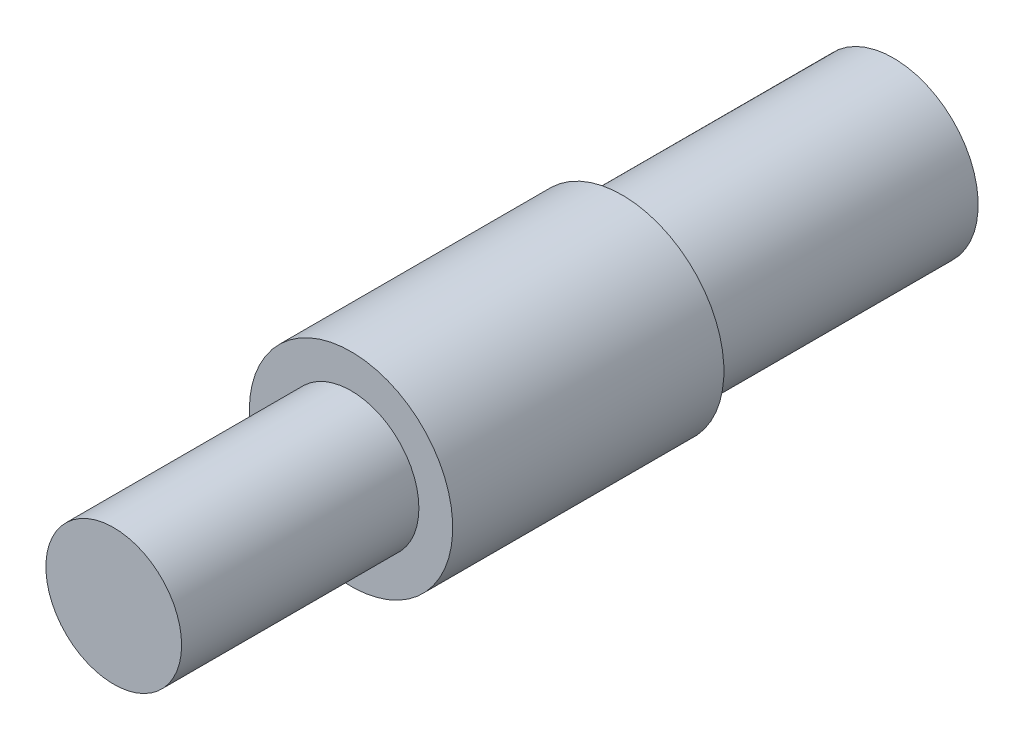
ISO-10303-21;
HEADER;
FILE_DESCRIPTION(('STEP AP214'),'2;1');
FILE_NAME('part.step','',(''),(''),'','','');
FILE_SCHEMA(('AUTOMOTIVE_DESIGN { 1 0 10303 214 1 1 1 1 }'));
ENDSEC;
DATA;
#1=APPLICATION_CONTEXT('core data for automotive mechanical design processes');
#2=APPLICATION_PROTOCOL_DEFINITION('international standard','automotive_design',2000,#1);
#3=PRODUCT_CONTEXT('',#1,'mechanical');
#4=PRODUCT('Part','Part','',(#3));
#5=PRODUCT_RELATED_PRODUCT_CATEGORY('part','',(#4));
#6=PRODUCT_DEFINITION_FORMATION('','',#4);
#7=PRODUCT_DEFINITION_CONTEXT('part definition',#1,'design');
#8=PRODUCT_DEFINITION('design','',#6,#7);
#9=PRODUCT_DEFINITION_SHAPE('','',#8);
#10=(LENGTH_UNIT() NAMED_UNIT(*) SI_UNIT(.MILLI.,.METRE.));
#11=(NAMED_UNIT(*) PLANE_ANGLE_UNIT() SI_UNIT($,.RADIAN.));
#12=(NAMED_UNIT(*) SI_UNIT($,.STERADIAN.) SOLID_ANGLE_UNIT());
#13=UNCERTAINTY_MEASURE_WITH_UNIT(LENGTH_MEASURE(1.E-05),#10,'distance_accuracy_value','');
#14=(GEOMETRIC_REPRESENTATION_CONTEXT(3) GLOBAL_UNCERTAINTY_ASSIGNED_CONTEXT((#13)) GLOBAL_UNIT_ASSIGNED_CONTEXT((#10,
#11,#12)) REPRESENTATION_CONTEXT('',''));
#15=CARTESIAN_POINT('',(0.,0.,0.));
#16=DIRECTION('',(0.,0.,1.));
#17=DIRECTION('',(1.,0.,0.));
#18=AXIS2_PLACEMENT_3D('',#15,#16,#17);
#19=CARTESIAN_POINT('',(0.,0.,-35.));
#20=DIRECTION('',(0.,0.,1.));
#21=DIRECTION('',(1.,0.,0.));
#22=AXIS2_PLACEMENT_3D('',#19,#20,#21);
#23=CYLINDRICAL_SURFACE('',#22,10.01);
#24=CARTESIAN_POINT('',(0.,0.,-35.));
#25=DIRECTION('',(0.,0.,1.));
#26=DIRECTION('',(1.,0.,0.));
#27=AXIS2_PLACEMENT_3D('',#24,#25,#26);
#28=CIRCLE('',#27,10.01);
#29=CARTESIAN_POINT('',(10.01,0.,-35.));
#30=VERTEX_POINT('',#29);
#31=EDGE_CURVE('E52',#30,#30,#28,.T.);
#32=ORIENTED_EDGE('',*,*,#31,.T.);
#33=EDGE_LOOP('',(#32));
#34=FACE_BOUND('',#33,.T.);
#35=CARTESIAN_POINT('',(0.,0.,0.));
#36=DIRECTION('',(0.,0.,1.));
#37=DIRECTION('',(1.,0.,0.));
#38=AXIS2_PLACEMENT_3D('',#35,#36,#37);
#39=CIRCLE('',#38,10.01);
#40=CARTESIAN_POINT('',(10.01,0.,0.));
#41=VERTEX_POINT('',#40);
#42=EDGE_CURVE('E41',#41,#41,#39,.T.);
#43=ORIENTED_EDGE('',*,*,#42,.F.);
#44=EDGE_LOOP('',(#43));
#45=FACE_BOUND('',#44,.T.);
#46=ADVANCED_FACE('F38',(#34,#45),#23,.T.);
#47=CARTESIAN_POINT('',(0.,0.,0.));
#48=DIRECTION('',(0.,0.,1.));
#49=DIRECTION('',(1.,0.,0.));
#50=AXIS2_PLACEMENT_3D('',#47,#48,#49);
#51=PLANE('',#50);
#52=ORIENTED_EDGE('',*,*,#42,.T.);
#53=EDGE_LOOP('',(#52));
#54=FACE_BOUND('',#53,.T.);
#55=ADVANCED_FACE('F80',(#54),#51,.T.);
#56=CARTESIAN_POINT('',(0.,0.,-75.));
#57=DIRECTION('',(0.,0.,1.));
#58=DIRECTION('',(1.,0.,0.));
#59=AXIS2_PLACEMENT_3D('',#56,#57,#58);
#60=CYLINDRICAL_SURFACE('',#59,15.);
#61=CARTESIAN_POINT('',(0.,0.,-75.));
#62=DIRECTION('',(0.,0.,-1.));
#63=DIRECTION('',(-1.,0.,0.));
#64=AXIS2_PLACEMENT_3D('',#61,#62,#63);
#65=CIRCLE('',#64,15.);
#66=CARTESIAN_POINT('',(-15.,0.,-75.));
#67=VERTEX_POINT('',#66);
#68=EDGE_CURVE('E56',#67,#67,#65,.T.);
#69=ORIENTED_EDGE('',*,*,#68,.F.);
#70=EDGE_LOOP('',(#69));
#71=FACE_BOUND('',#70,.T.);
#72=CARTESIAN_POINT('',(0.,0.,-35.));
#73=DIRECTION('',(0.,0.,-1.));
#74=DIRECTION('',(-1.,0.,0.));
#75=AXIS2_PLACEMENT_3D('',#72,#73,#74);
#76=CIRCLE('',#75,15.);
#77=CARTESIAN_POINT('',(-15.,0.,-35.));
#78=VERTEX_POINT('',#77);
#79=EDGE_CURVE('E60',#78,#78,#76,.T.);
#80=ORIENTED_EDGE('',*,*,#79,.T.);
#81=EDGE_LOOP('',(#80));
#82=FACE_BOUND('',#81,.T.);
#83=ADVANCED_FACE('F78',(#71,#82),#60,.T.);
#84=CARTESIAN_POINT('',(0.,0.,-75.));
#85=DIRECTION('',(0.,0.,-1.));
#86=DIRECTION('',(-1.,0.,0.));
#87=AXIS2_PLACEMENT_3D('',#84,#85,#86);
#88=PLANE('',#87);
#89=CARTESIAN_POINT('',(0.,0.,-75.));
#90=DIRECTION('',(0.,0.,-1.));
#91=DIRECTION('',(-1.,0.,0.));
#92=AXIS2_PLACEMENT_3D('',#89,#90,#91);
#93=CIRCLE('',#92,12.5);
#94=CARTESIAN_POINT('',(-12.5,0.,-75.));
#95=VERTEX_POINT('',#94);
#96=EDGE_CURVE('E10',#95,#95,#93,.T.);
#97=ORIENTED_EDGE('',*,*,#96,.F.);
#98=EDGE_LOOP('',(#97));
#99=FACE_BOUND('',#98,.T.);
#100=ORIENTED_EDGE('',*,*,#68,.T.);
#101=EDGE_LOOP('',(#100));
#102=FACE_BOUND('',#101,.T.);
#103=ADVANCED_FACE('F74',(#99,#102),#88,.T.);
#104=CARTESIAN_POINT('',(0.,0.,-35.));
#105=DIRECTION('',(0.,0.,-1.));
#106=DIRECTION('',(-1.,0.,0.));
#107=AXIS2_PLACEMENT_3D('',#104,#105,#106);
#108=PLANE('',#107);
#109=ORIENTED_EDGE('',*,*,#31,.F.);
#110=EDGE_LOOP('',(#109));
#111=FACE_BOUND('',#110,.T.);
#112=ORIENTED_EDGE('',*,*,#79,.F.);
#113=EDGE_LOOP('',(#112));
#114=FACE_BOUND('',#113,.T.);
#115=ADVANCED_FACE('F70',(#111,#114),#108,.F.);
#116=CARTESIAN_POINT('',(0.,0.,-115.));
#117=DIRECTION('',(0.,0.,1.));
#118=DIRECTION('',(1.,0.,0.));
#119=AXIS2_PLACEMENT_3D('',#116,#117,#118);
#120=CYLINDRICAL_SURFACE('',#119,12.5);
#121=CARTESIAN_POINT('',(0.,0.,-115.));
#122=DIRECTION('',(0.,0.,-1.));
#123=DIRECTION('',(-1.,0.,0.));
#124=AXIS2_PLACEMENT_3D('',#121,#122,#123);
#125=CIRCLE('',#124,12.5);
#126=CARTESIAN_POINT('',(-12.5,0.,-115.));
#127=VERTEX_POINT('',#126);
#128=EDGE_CURVE('E55',#127,#127,#125,.T.);
#129=ORIENTED_EDGE('',*,*,#128,.F.);
#130=EDGE_LOOP('',(#129));
#131=FACE_BOUND('',#130,.T.);
#132=ORIENTED_EDGE('',*,*,#96,.T.);
#133=EDGE_LOOP('',(#132));
#134=FACE_BOUND('',#133,.T.);
#135=ADVANCED_FACE('F73',(#131,#134),#120,.T.);
#136=CARTESIAN_POINT('',(0.,0.,-115.));
#137=DIRECTION('',(0.,0.,-1.));
#138=DIRECTION('',(-1.,0.,0.));
#139=AXIS2_PLACEMENT_3D('',#136,#137,#138);
#140=PLANE('',#139);
#141=ORIENTED_EDGE('',*,*,#128,.T.);
#142=EDGE_LOOP('',(#141));
#143=FACE_BOUND('',#142,.T.);
#144=ADVANCED_FACE('F123',(#143),#140,.T.);
#145=CLOSED_SHELL('',(#46,#55,#83,#103,#115,#135,#144));
#146=MANIFOLD_SOLID_BREP('B2',#145);
#147=ADVANCED_BREP_SHAPE_REPRESENTATION('',(#18,#146),#14);
#148=SHAPE_DEFINITION_REPRESENTATION(#9,#147);
ENDSEC;
END-ISO-10303-21;
